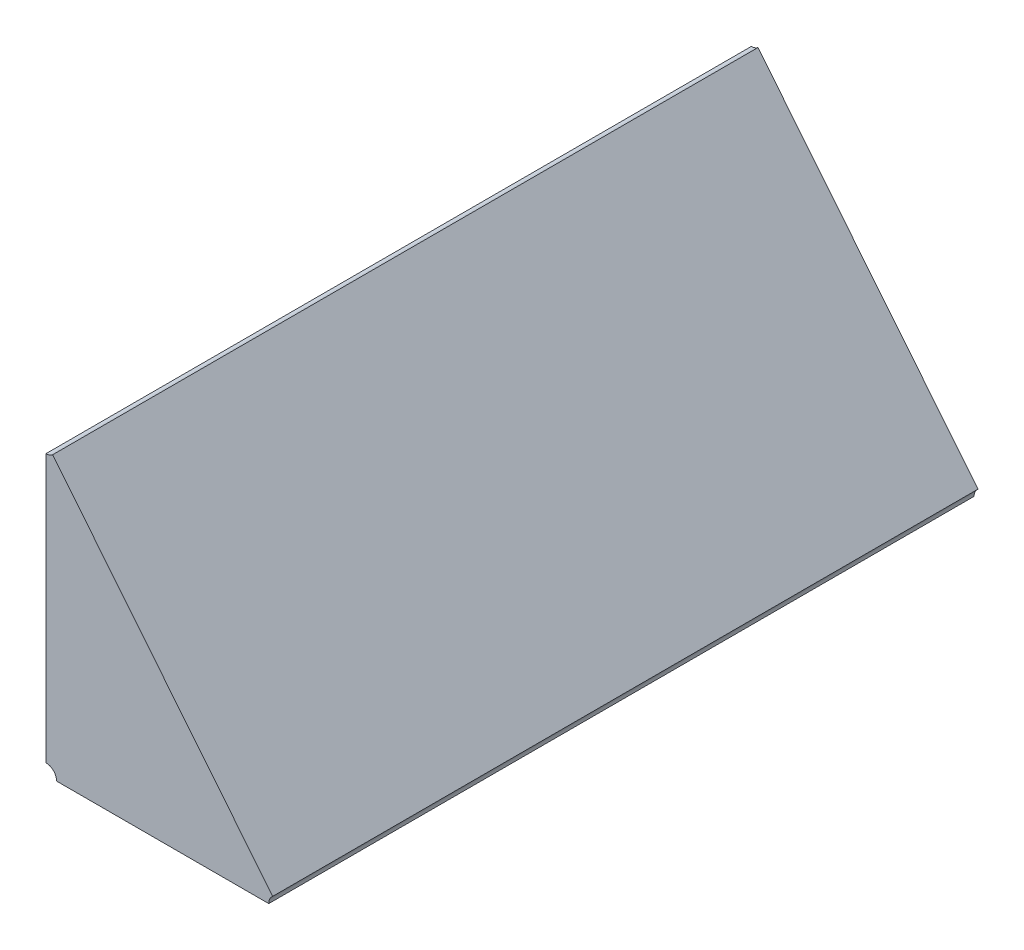
ISO-10303-21;
HEADER;
FILE_DESCRIPTION(('STEP AP214'),'2;1');
FILE_NAME('part.step','',(''),(''),'','','');
FILE_SCHEMA(('AUTOMOTIVE_DESIGN { 1 0 10303 214 1 1 1 1 }'));
ENDSEC;
DATA;
#1=APPLICATION_CONTEXT('core data for automotive mechanical design processes');
#2=APPLICATION_PROTOCOL_DEFINITION('international standard','automotive_design',2000,#1);
#3=PRODUCT_CONTEXT('',#1,'mechanical');
#4=PRODUCT('Part','Part','',(#3));
#5=PRODUCT_RELATED_PRODUCT_CATEGORY('part','',(#4));
#6=PRODUCT_DEFINITION_FORMATION('','',#4);
#7=PRODUCT_DEFINITION_CONTEXT('part definition',#1,'design');
#8=PRODUCT_DEFINITION('design','',#6,#7);
#9=PRODUCT_DEFINITION_SHAPE('','',#8);
#10=(LENGTH_UNIT() NAMED_UNIT(*) SI_UNIT(.MILLI.,.METRE.));
#11=(NAMED_UNIT(*) PLANE_ANGLE_UNIT() SI_UNIT($,.RADIAN.));
#12=(NAMED_UNIT(*) SI_UNIT($,.STERADIAN.) SOLID_ANGLE_UNIT());
#13=UNCERTAINTY_MEASURE_WITH_UNIT(LENGTH_MEASURE(1.E-05),#10,'distance_accuracy_value','');
#14=(GEOMETRIC_REPRESENTATION_CONTEXT(3) GLOBAL_UNCERTAINTY_ASSIGNED_CONTEXT((#13)) GLOBAL_UNIT_ASSIGNED_CONTEXT((#10,
#11,#12)) REPRESENTATION_CONTEXT('',''));
#15=CARTESIAN_POINT('',(0.,0.,0.));
#16=DIRECTION('',(0.,0.,1.));
#17=DIRECTION('',(1.,0.,0.));
#18=AXIS2_PLACEMENT_3D('',#15,#16,#17);
#19=CARTESIAN_POINT('',(-0.787409473268436,-0.763779828951434,0.1));
#20=DIRECTION('',(0.,0.,1.));
#21=DIRECTION('',(1.,0.,0.));
#22=AXIS2_PLACEMENT_3D('',#19,#20,#21);
#23=PLANE('',#22);
#24=CARTESIAN_POINT('',(-0.798601549558721,-0.778912469373211,0.1));
#25=DIRECTION('',(0.,0.,-1.));
#26=DIRECTION('',(0.,1.,0.));
#27=AXIS2_PLACEMENT_3D('',#24,#25,#26);
#28=CIRCLE('',#27,0.0015);
#29=CARTESIAN_POINT('',(-0.798601549558721,-0.777412469373211,0.1));
#30=VERTEX_POINT('',#29);
#31=CARTESIAN_POINT('',(-0.797101549558721,-0.778912469373211,0.1));
#32=VERTEX_POINT('',#31);
#33=EDGE_CURVE('E11',#30,#32,#28,.T.);
#34=ORIENTED_EDGE('',*,*,#33,.T.);
#35=DIRECTION('',(1.,0.,0.));
#36=VECTOR('',#35,1.);
#37=CARTESIAN_POINT('',(-0.797101549558721,-0.778912469373211,0.1));
#38=LINE('',#37,#36);
#39=CARTESIAN_POINT('',(-0.767022478707326,-0.778912469373211,0.1));
#40=VERTEX_POINT('',#39);
#41=EDGE_CURVE('E83',#32,#40,#38,.T.);
#42=ORIENTED_EDGE('',*,*,#41,.T.);
#43=CARTESIAN_POINT('',(-0.765522478707326,-0.778912469373211,0.1));
#44=DIRECTION('',(0.,0.,-1.));
#45=DIRECTION('',(-1.,0.,0.));
#46=AXIS2_PLACEMENT_3D('',#43,#44,#45);
#47=CIRCLE('',#46,0.0015);
#48=CARTESIAN_POINT('',(-0.766464912520002,-0.777745499575518,0.1));
#49=VERTEX_POINT('',#48);
#50=EDGE_CURVE('E107',#40,#49,#47,.T.);
#51=ORIENTED_EDGE('',*,*,#50,.T.);
#52=DIRECTION('',(-0.628289208450211,0.777979865128274,0.));
#53=VECTOR('',#52,1.);
#54=CARTESIAN_POINT('',(-0.766464912520002,-0.777745499575518,0.1));
#55=LINE('',#54,#53);
#56=CARTESIAN_POINT('',(-0.797659115746046,-0.739119240056523,0.1));
#57=VERTEX_POINT('',#56);
#58=EDGE_CURVE('E110',#49,#57,#55,.T.);
#59=ORIENTED_EDGE('',*,*,#58,.T.);
#60=CARTESIAN_POINT('',(-0.798601549558721,-0.737952270258831,0.1));
#61=DIRECTION('',(0.,0.,-1.));
#62=DIRECTION('',(0.628289208450231,-0.777979865128258,0.));
#63=AXIS2_PLACEMENT_3D('',#60,#61,#62);
#64=CIRCLE('',#63,0.0015);
#65=CARTESIAN_POINT('',(-0.798601549558721,-0.739452270258831,0.1));
#66=VERTEX_POINT('',#65);
#67=EDGE_CURVE('E74',#57,#66,#64,.T.);
#68=ORIENTED_EDGE('',*,*,#67,.T.);
#69=DIRECTION('',(0.,-1.,0.));
#70=VECTOR('',#69,1.);
#71=CARTESIAN_POINT('',(-0.798601549558721,-0.739452270258831,0.1));
#72=LINE('',#71,#70);
#73=EDGE_CURVE('E103',#66,#30,#72,.T.);
#74=ORIENTED_EDGE('',*,*,#73,.T.);
#75=EDGE_LOOP('',(#34,#42,#51,#59,#68,#74));
#76=FACE_BOUND('',#75,.T.);
#77=ADVANCED_FACE('F17',(#76),#23,.T.);
#78=CARTESIAN_POINT('',(-0.765522478707326,-0.778912469373211,0.));
#79=DIRECTION('',(0.777979865128274,0.628289208450211,0.));
#80=DIRECTION('',(-0.628289208450211,0.777979865128274,0.));
#81=AXIS2_PLACEMENT_3D('',#78,#79,#80);
#82=PLANE('',#81);
#83=DIRECTION('',(0.,0.,1.));
#84=VECTOR('',#83,1.);
#85=CARTESIAN_POINT('',(-0.797659115746046,-0.739119240056523,0.));
#86=LINE('',#85,#84);
#87=CARTESIAN_POINT('',(-0.797659115746046,-0.739119240056523,0.));
#88=VERTEX_POINT('',#87);
#89=EDGE_CURVE('E24',#88,#57,#86,.T.);
#90=ORIENTED_EDGE('',*,*,#89,.T.);
#91=ORIENTED_EDGE('',*,*,#58,.F.);
#92=DIRECTION('',(0.,0.,-1.));
#93=VECTOR('',#92,1.);
#94=CARTESIAN_POINT('',(-0.766464912520002,-0.777745499575518,0.1));
#95=LINE('',#94,#93);
#96=CARTESIAN_POINT('',(-0.766464912520002,-0.777745499575518,0.));
#97=VERTEX_POINT('',#96);
#98=EDGE_CURVE('E68',#49,#97,#95,.T.);
#99=ORIENTED_EDGE('',*,*,#98,.T.);
#100=DIRECTION('',(-0.628289208450211,0.777979865128274,0.));
#101=VECTOR('',#100,1.);
#102=CARTESIAN_POINT('',(-0.766464912520002,-0.777745499575518,0.));
#103=LINE('',#102,#101);
#104=EDGE_CURVE('E65',#97,#88,#103,.T.);
#105=ORIENTED_EDGE('',*,*,#104,.T.);
#106=EDGE_LOOP('',(#90,#91,#99,#105));
#107=FACE_BOUND('',#106,.T.);
#108=ADVANCED_FACE('F66',(#107),#82,.T.);
#109=CARTESIAN_POINT('',(-0.798601549558721,-0.737952270258831,0.));
#110=DIRECTION('',(-1.,0.,0.));
#111=DIRECTION('',(0.,-1.,0.));
#112=AXIS2_PLACEMENT_3D('',#109,#110,#111);
#113=PLANE('',#112);
#114=DIRECTION('',(0.,0.,1.));
#115=VECTOR('',#114,1.);
#116=CARTESIAN_POINT('',(-0.798601549558721,-0.777412469373211,0.));
#117=LINE('',#116,#115);
#118=CARTESIAN_POINT('',(-0.798601549558721,-0.777412469373211,0.));
#119=VERTEX_POINT('',#118);
#120=EDGE_CURVE('E112',#119,#30,#117,.T.);
#121=ORIENTED_EDGE('',*,*,#120,.T.);
#122=ORIENTED_EDGE('',*,*,#73,.F.);
#123=DIRECTION('',(0.,0.,-1.));
#124=VECTOR('',#123,1.);
#125=CARTESIAN_POINT('',(-0.798601549558721,-0.739452270258831,0.1));
#126=LINE('',#125,#124);
#127=CARTESIAN_POINT('',(-0.798601549558721,-0.739452270258831,0.));
#128=VERTEX_POINT('',#127);
#129=EDGE_CURVE('E73',#66,#128,#126,.T.);
#130=ORIENTED_EDGE('',*,*,#129,.T.);
#131=DIRECTION('',(0.,-1.,0.));
#132=VECTOR('',#131,1.);
#133=CARTESIAN_POINT('',(-0.798601549558721,-0.739452270258831,0.));
#134=LINE('',#133,#132);
#135=EDGE_CURVE('E87',#128,#119,#134,.T.);
#136=ORIENTED_EDGE('',*,*,#135,.T.);
#137=EDGE_LOOP('',(#121,#122,#130,#136));
#138=FACE_BOUND('',#137,.T.);
#139=ADVANCED_FACE('F126',(#138),#113,.T.);
#140=CARTESIAN_POINT('',(-0.798601549558721,-0.778912469373211,0.));
#141=DIRECTION('',(0.,-1.,0.));
#142=DIRECTION('',(1.,0.,0.));
#143=AXIS2_PLACEMENT_3D('',#140,#141,#142);
#144=PLANE('',#143);
#145=DIRECTION('',(0.,0.,-1.));
#146=VECTOR('',#145,1.);
#147=CARTESIAN_POINT('',(-0.797101549558721,-0.778912469373211,0.1));
#148=LINE('',#147,#146);
#149=CARTESIAN_POINT('',(-0.797101549558721,-0.778912469373211,0.));
#150=VERTEX_POINT('',#149);
#151=EDGE_CURVE('E105',#32,#150,#148,.T.);
#152=ORIENTED_EDGE('',*,*,#151,.T.);
#153=DIRECTION('',(1.,0.,0.));
#154=VECTOR('',#153,1.);
#155=CARTESIAN_POINT('',(-0.797101549558721,-0.778912469373211,0.));
#156=LINE('',#155,#154);
#157=CARTESIAN_POINT('',(-0.767022478707326,-0.778912469373211,0.));
#158=VERTEX_POINT('',#157);
#159=EDGE_CURVE('E98',#150,#158,#156,.T.);
#160=ORIENTED_EDGE('',*,*,#159,.T.);
#161=DIRECTION('',(0.,0.,1.));
#162=VECTOR('',#161,1.);
#163=CARTESIAN_POINT('',(-0.767022478707326,-0.778912469373211,0.));
#164=LINE('',#163,#162);
#165=EDGE_CURVE('E88',#158,#40,#164,.T.);
#166=ORIENTED_EDGE('',*,*,#165,.T.);
#167=ORIENTED_EDGE('',*,*,#41,.F.);
#168=EDGE_LOOP('',(#152,#160,#166,#167));
#169=FACE_BOUND('',#168,.T.);
#170=ADVANCED_FACE('F118',(#169),#144,.T.);
#171=CARTESIAN_POINT('',(-0.787409473268436,-0.763779828951434,0.));
#172=DIRECTION('',(0.,0.,1.));
#173=DIRECTION('',(1.,0.,0.));
#174=AXIS2_PLACEMENT_3D('',#171,#172,#173);
#175=PLANE('',#174);
#176=CARTESIAN_POINT('',(-0.798601549558721,-0.778912469373211,0.));
#177=DIRECTION('',(0.,0.,1.));
#178=DIRECTION('',(1.,0.,0.));
#179=AXIS2_PLACEMENT_3D('',#176,#177,#178);
#180=CIRCLE('',#179,0.0015);
#181=EDGE_CURVE('E100',#150,#119,#180,.T.);
#182=ORIENTED_EDGE('',*,*,#181,.T.);
#183=ORIENTED_EDGE('',*,*,#135,.F.);
#184=CARTESIAN_POINT('',(-0.798601549558721,-0.737952270258831,0.));
#185=DIRECTION('',(0.,0.,1.));
#186=DIRECTION('',(0.,-1.,0.));
#187=AXIS2_PLACEMENT_3D('',#184,#185,#186);
#188=CIRCLE('',#187,0.0015);
#189=EDGE_CURVE('E81',#128,#88,#188,.T.);
#190=ORIENTED_EDGE('',*,*,#189,.T.);
#191=ORIENTED_EDGE('',*,*,#104,.F.);
#192=CARTESIAN_POINT('',(-0.765522478707326,-0.778912469373211,0.));
#193=DIRECTION('',(0.,0.,1.));
#194=DIRECTION('',(-0.628289208450276,0.777979865128222,0.));
#195=AXIS2_PLACEMENT_3D('',#192,#193,#194);
#196=CIRCLE('',#195,0.0015);
#197=EDGE_CURVE('E89',#97,#158,#196,.T.);
#198=ORIENTED_EDGE('',*,*,#197,.T.);
#199=ORIENTED_EDGE('',*,*,#159,.F.);
#200=EDGE_LOOP('',(#182,#183,#190,#191,#198,#199));
#201=FACE_BOUND('',#200,.T.);
#202=ADVANCED_FACE('F85',(#201),#175,.F.);
#203=CARTESIAN_POINT('',(-0.765522478707326,-0.778912469373211,0.1));
#204=DIRECTION('',(0.,0.,1.));
#205=DIRECTION('',(-1.,0.,0.));
#206=AXIS2_PLACEMENT_3D('',#203,#204,#205);
#207=CYLINDRICAL_SURFACE('',#206,0.0015);
#208=ORIENTED_EDGE('',*,*,#98,.F.);
#209=ORIENTED_EDGE('',*,*,#50,.F.);
#210=ORIENTED_EDGE('',*,*,#165,.F.);
#211=ORIENTED_EDGE('',*,*,#197,.F.);
#212=EDGE_LOOP('',(#208,#209,#210,#211));
#213=FACE_BOUND('',#212,.T.);
#214=ADVANCED_FACE('F121',(#213),#207,.F.);
#215=CARTESIAN_POINT('',(-0.798601549558721,-0.737952270258831,0.1));
#216=DIRECTION('',(0.,0.,1.));
#217=DIRECTION('',(-1.,0.,0.));
#218=AXIS2_PLACEMENT_3D('',#215,#216,#217);
#219=CYLINDRICAL_SURFACE('',#218,0.0015);
#220=ORIENTED_EDGE('',*,*,#89,.F.);
#221=ORIENTED_EDGE('',*,*,#189,.F.);
#222=ORIENTED_EDGE('',*,*,#129,.F.);
#223=ORIENTED_EDGE('',*,*,#67,.F.);
#224=EDGE_LOOP('',(#220,#221,#222,#223));
#225=FACE_BOUND('',#224,.T.);
#226=ADVANCED_FACE('F79',(#225),#219,.F.);
#227=CARTESIAN_POINT('',(-0.798601549558721,-0.778912469373211,0.1));
#228=DIRECTION('',(0.,0.,1.));
#229=DIRECTION('',(-1.,0.,0.));
#230=AXIS2_PLACEMENT_3D('',#227,#228,#229);
#231=CYLINDRICAL_SURFACE('',#230,0.0015);
#232=ORIENTED_EDGE('',*,*,#120,.F.);
#233=ORIENTED_EDGE('',*,*,#181,.F.);
#234=ORIENTED_EDGE('',*,*,#151,.F.);
#235=ORIENTED_EDGE('',*,*,#33,.F.);
#236=EDGE_LOOP('',(#232,#233,#234,#235));
#237=FACE_BOUND('',#236,.T.);
#238=ADVANCED_FACE('F127',(#237),#231,.F.);
#239=CLOSED_SHELL('',(#77,#108,#139,#170,#202,#214,#226,#238));
#240=MANIFOLD_SOLID_BREP('B1',#239);
#241=ADVANCED_BREP_SHAPE_REPRESENTATION('',(#18,#240),#14);
#242=SHAPE_DEFINITION_REPRESENTATION(#9,#241);
ENDSEC;
END-ISO-10303-21;
